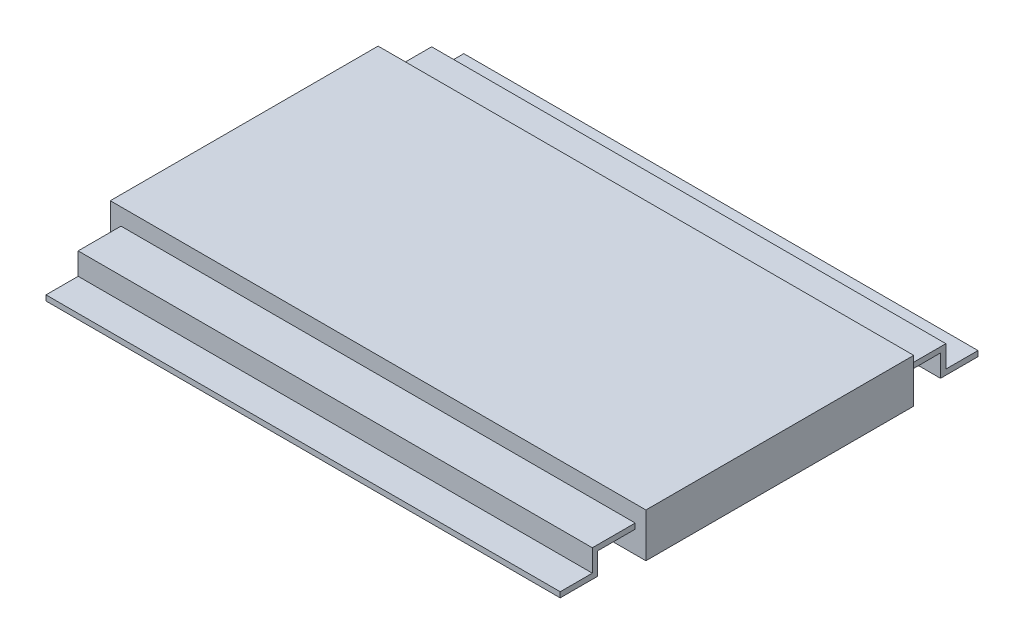
ISO-10303-21;
HEADER;
FILE_DESCRIPTION(('STEP AP214'),'2;1');
FILE_NAME('part.step','',(''),(''),'','','');
FILE_SCHEMA(('AUTOMOTIVE_DESIGN { 1 0 10303 214 1 1 1 1 }'));
ENDSEC;
DATA;
#1=APPLICATION_CONTEXT('core data for automotive mechanical design processes');
#2=APPLICATION_PROTOCOL_DEFINITION('international standard','automotive_design',2000,#1);
#3=PRODUCT_CONTEXT('',#1,'mechanical');
#4=PRODUCT('Part','Part','',(#3));
#5=PRODUCT_RELATED_PRODUCT_CATEGORY('part','',(#4));
#6=PRODUCT_DEFINITION_FORMATION('','',#4);
#7=PRODUCT_DEFINITION_CONTEXT('part definition',#1,'design');
#8=PRODUCT_DEFINITION('design','',#6,#7);
#9=PRODUCT_DEFINITION_SHAPE('','',#8);
#10=(LENGTH_UNIT() NAMED_UNIT(*) SI_UNIT(.MILLI.,.METRE.));
#11=(NAMED_UNIT(*) PLANE_ANGLE_UNIT() SI_UNIT($,.RADIAN.));
#12=(NAMED_UNIT(*) SI_UNIT($,.STERADIAN.) SOLID_ANGLE_UNIT());
#13=UNCERTAINTY_MEASURE_WITH_UNIT(LENGTH_MEASURE(1.E-05),#10,'distance_accuracy_value','');
#14=(GEOMETRIC_REPRESENTATION_CONTEXT(3) GLOBAL_UNCERTAINTY_ASSIGNED_CONTEXT((#13)) GLOBAL_UNIT_ASSIGNED_CONTEXT((#10,
#11,#12)) REPRESENTATION_CONTEXT('',''));
#15=CARTESIAN_POINT('',(0.,0.,0.));
#16=DIRECTION('',(0.,0.,1.));
#17=DIRECTION('',(1.,0.,0.));
#18=AXIS2_PLACEMENT_3D('',#15,#16,#17);
#19=CARTESIAN_POINT('',(6.35,1.044000004,3.175));
#20=DIRECTION('',(0.,0.,-1.));
#21=DIRECTION('',(0.,1.,0.));
#22=AXIS2_PLACEMENT_3D('',#19,#20,#21);
#23=PLANE('',#22);
#24=DIRECTION('',(0.,-1.,0.));
#25=VECTOR('',#24,1.);
#26=CARTESIAN_POINT('',(-6.35,1.044000004,3.175));
#27=LINE('',#26,#25);
#28=CARTESIAN_POINT('',(-6.35,1.044000004,3.175));
#29=VERTEX_POINT('',#28);
#30=CARTESIAN_POINT('',(-6.35,0.,3.175));
#31=VERTEX_POINT('',#30);
#32=EDGE_CURVE('E302',#29,#31,#27,.T.);
#33=ORIENTED_EDGE('',*,*,#32,.T.);
#34=DIRECTION('',(-1.,0.,0.));
#35=VECTOR('',#34,1.);
#36=CARTESIAN_POINT('',(6.35,0.,3.175));
#37=LINE('',#36,#35);
#38=CARTESIAN_POINT('',(6.35,0.,3.175));
#39=VERTEX_POINT('',#38);
#40=EDGE_CURVE('E11',#39,#31,#37,.T.);
#41=ORIENTED_EDGE('',*,*,#40,.F.);
#42=DIRECTION('',(0.,-1.,0.));
#43=VECTOR('',#42,1.);
#44=CARTESIAN_POINT('',(6.35,1.044000004,3.175));
#45=LINE('',#44,#43);
#46=CARTESIAN_POINT('',(6.35,1.044000004,3.175));
#47=VERTEX_POINT('',#46);
#48=EDGE_CURVE('E303',#47,#39,#45,.T.);
#49=ORIENTED_EDGE('',*,*,#48,.F.);
#50=DIRECTION('',(-1.,0.,0.));
#51=VECTOR('',#50,1.);
#52=CARTESIAN_POINT('',(6.35,1.044000004,3.175));
#53=LINE('',#52,#51);
#54=EDGE_CURVE('E313',#47,#29,#53,.T.);
#55=ORIENTED_EDGE('',*,*,#54,.T.);
#56=EDGE_LOOP('',(#33,#41,#49,#55));
#57=FACE_BOUND('',#56,.T.);
#58=DIRECTION('',(0.,1.,0.));
#59=VECTOR('',#58,1.);
#60=CARTESIAN_POINT('',(6.096,0.522000002000001,3.175));
#61=LINE('',#60,#59);
#62=CARTESIAN_POINT('',(6.096,0.522000002000001,3.175));
#63=VERTEX_POINT('',#62);
#64=CARTESIAN_POINT('',(6.096,0.649000002000001,3.175));
#65=VERTEX_POINT('',#64);
#66=EDGE_CURVE('E199',#63,#65,#61,.T.);
#67=ORIENTED_EDGE('',*,*,#66,.F.);
#68=DIRECTION('',(-1.,0.,0.));
#69=VECTOR('',#68,1.);
#70=CARTESIAN_POINT('',(6.096,0.522000002000001,3.175));
#71=LINE('',#70,#69);
#72=CARTESIAN_POINT('',(-6.096,0.522000002000001,3.175));
#73=VERTEX_POINT('',#72);
#74=EDGE_CURVE('E239',#63,#73,#71,.T.);
#75=ORIENTED_EDGE('',*,*,#74,.T.);
#76=DIRECTION('',(0.,1.,0.));
#77=VECTOR('',#76,1.);
#78=CARTESIAN_POINT('',(-6.096,0.522000002000001,3.175));
#79=LINE('',#78,#77);
#80=CARTESIAN_POINT('',(-6.096,0.649000002000001,3.175));
#81=VERTEX_POINT('',#80);
#82=EDGE_CURVE('E217',#73,#81,#79,.T.);
#83=ORIENTED_EDGE('',*,*,#82,.T.);
#84=DIRECTION('',(-1.,0.,0.));
#85=VECTOR('',#84,1.);
#86=CARTESIAN_POINT('',(6.096,0.649000002000001,3.175));
#87=LINE('',#86,#85);
#88=EDGE_CURVE('E237',#65,#81,#87,.T.);
#89=ORIENTED_EDGE('',*,*,#88,.F.);
#90=EDGE_LOOP('',(#67,#75,#83,#89));
#91=FACE_BOUND('',#90,.T.);
#92=ADVANCED_FACE('F35',(#57,#91),#23,.F.);
#93=CARTESIAN_POINT('',(6.35,1.044000004,-3.175));
#94=DIRECTION('',(0.,0.,1.));
#95=DIRECTION('',(0.,-1.,0.));
#96=AXIS2_PLACEMENT_3D('',#93,#94,#95);
#97=PLANE('',#96);
#98=DIRECTION('',(0.,1.,0.));
#99=VECTOR('',#98,1.);
#100=CARTESIAN_POINT('',(-6.35,1.044000004,-3.175));
#101=LINE('',#100,#99);
#102=CARTESIAN_POINT('',(-6.35,0.,-3.175));
#103=VERTEX_POINT('',#102);
#104=CARTESIAN_POINT('',(-6.35,1.044000004,-3.175));
#105=VERTEX_POINT('',#104);
#106=EDGE_CURVE('E318',#103,#105,#101,.T.);
#107=ORIENTED_EDGE('',*,*,#106,.T.);
#108=DIRECTION('',(-1.,0.,0.));
#109=VECTOR('',#108,1.);
#110=CARTESIAN_POINT('',(6.35,1.044000004,-3.175));
#111=LINE('',#110,#109);
#112=CARTESIAN_POINT('',(6.35,1.044000004,-3.175));
#113=VERTEX_POINT('',#112);
#114=EDGE_CURVE('E323',#113,#105,#111,.T.);
#115=ORIENTED_EDGE('',*,*,#114,.F.);
#116=DIRECTION('',(0.,1.,0.));
#117=VECTOR('',#116,1.);
#118=CARTESIAN_POINT('',(6.35,1.044000004,-3.175));
#119=LINE('',#118,#117);
#120=CARTESIAN_POINT('',(6.35,0.,-3.175));
#121=VERTEX_POINT('',#120);
#122=EDGE_CURVE('E309',#121,#113,#119,.T.);
#123=ORIENTED_EDGE('',*,*,#122,.F.);
#124=DIRECTION('',(-1.,0.,0.));
#125=VECTOR('',#124,1.);
#126=CARTESIAN_POINT('',(6.35,0.,-3.175));
#127=LINE('',#126,#125);
#128=EDGE_CURVE('E42',#121,#103,#127,.T.);
#129=ORIENTED_EDGE('',*,*,#128,.T.);
#130=EDGE_LOOP('',(#107,#115,#123,#129));
#131=FACE_BOUND('',#130,.T.);
#132=DIRECTION('',(0.,1.,0.));
#133=VECTOR('',#132,1.);
#134=CARTESIAN_POINT('',(6.096,0.522000002000001,-3.175));
#135=LINE('',#134,#133);
#136=CARTESIAN_POINT('',(6.096,0.522000002000001,-3.175));
#137=VERTEX_POINT('',#136);
#138=CARTESIAN_POINT('',(6.096,0.649000002000001,-3.175));
#139=VERTEX_POINT('',#138);
#140=EDGE_CURVE('E258',#137,#139,#135,.T.);
#141=ORIENTED_EDGE('',*,*,#140,.T.);
#142=DIRECTION('',(-1.,0.,0.));
#143=VECTOR('',#142,1.);
#144=CARTESIAN_POINT('',(6.096,0.649000002000001,-3.175));
#145=LINE('',#144,#143);
#146=CARTESIAN_POINT('',(-6.096,0.649000002000001,-3.175));
#147=VERTEX_POINT('',#146);
#148=EDGE_CURVE('E291',#139,#147,#145,.T.);
#149=ORIENTED_EDGE('',*,*,#148,.T.);
#150=DIRECTION('',(0.,1.,0.));
#151=VECTOR('',#150,1.);
#152=CARTESIAN_POINT('',(-6.096,0.522000002000001,-3.175));
#153=LINE('',#152,#151);
#154=CARTESIAN_POINT('',(-6.096,0.522000002000001,-3.175));
#155=VERTEX_POINT('',#154);
#156=EDGE_CURVE('E280',#155,#147,#153,.T.);
#157=ORIENTED_EDGE('',*,*,#156,.F.);
#158=DIRECTION('',(-1.,0.,0.));
#159=VECTOR('',#158,1.);
#160=CARTESIAN_POINT('',(6.096,0.522000002000001,-3.175));
#161=LINE('',#160,#159);
#162=EDGE_CURVE('E289',#137,#155,#161,.T.);
#163=ORIENTED_EDGE('',*,*,#162,.F.);
#164=EDGE_LOOP('',(#141,#149,#157,#163));
#165=FACE_BOUND('',#164,.T.);
#166=ADVANCED_FACE('F330',(#131,#165),#97,.F.);
#167=CARTESIAN_POINT('',(6.35,0.,3.175));
#168=DIRECTION('',(0.,1.,0.));
#169=DIRECTION('',(0.,0.,1.));
#170=AXIS2_PLACEMENT_3D('',#167,#168,#169);
#171=PLANE('',#170);
#172=DIRECTION('',(0.,0.,-1.));
#173=VECTOR('',#172,1.);
#174=CARTESIAN_POINT('',(-6.35,0.,3.175));
#175=LINE('',#174,#173);
#176=EDGE_CURVE('E316',#31,#103,#175,.T.);
#177=ORIENTED_EDGE('',*,*,#176,.T.);
#178=ORIENTED_EDGE('',*,*,#128,.F.);
#179=DIRECTION('',(0.,0.,-1.));
#180=VECTOR('',#179,1.);
#181=CARTESIAN_POINT('',(6.35,0.,3.175));
#182=LINE('',#181,#180);
#183=EDGE_CURVE('E306',#39,#121,#182,.T.);
#184=ORIENTED_EDGE('',*,*,#183,.F.);
#185=ORIENTED_EDGE('',*,*,#40,.T.);
#186=EDGE_LOOP('',(#177,#178,#184,#185));
#187=FACE_BOUND('',#186,.T.);
#188=ADVANCED_FACE('F348',(#187),#171,.F.);
#189=CARTESIAN_POINT('',(6.35,1.044000004,3.175));
#190=DIRECTION('',(0.,-1.,0.));
#191=DIRECTION('',(0.,0.,-1.));
#192=AXIS2_PLACEMENT_3D('',#189,#190,#191);
#193=PLANE('',#192);
#194=DIRECTION('',(0.,0.,1.));
#195=VECTOR('',#194,1.);
#196=CARTESIAN_POINT('',(-6.35,1.044000004,3.175));
#197=LINE('',#196,#195);
#198=EDGE_CURVE('E307',#105,#29,#197,.T.);
#199=ORIENTED_EDGE('',*,*,#198,.T.);
#200=ORIENTED_EDGE('',*,*,#54,.F.);
#201=DIRECTION('',(0.,0.,1.));
#202=VECTOR('',#201,1.);
#203=CARTESIAN_POINT('',(6.35,1.044000004,3.175));
#204=LINE('',#203,#202);
#205=EDGE_CURVE('E311',#113,#47,#204,.T.);
#206=ORIENTED_EDGE('',*,*,#205,.F.);
#207=ORIENTED_EDGE('',*,*,#114,.T.);
#208=EDGE_LOOP('',(#199,#200,#206,#207));
#209=FACE_BOUND('',#208,.T.);
#210=ADVANCED_FACE('F340',(#209),#193,.F.);
#211=CARTESIAN_POINT('',(6.35,0.,0.));
#212=DIRECTION('',(1.,0.,0.));
#213=DIRECTION('',(0.,0.,-1.));
#214=AXIS2_PLACEMENT_3D('',#211,#212,#213);
#215=PLANE('',#214);
#216=ORIENTED_EDGE('',*,*,#48,.T.);
#217=ORIENTED_EDGE('',*,*,#183,.T.);
#218=ORIENTED_EDGE('',*,*,#122,.T.);
#219=ORIENTED_EDGE('',*,*,#205,.T.);
#220=EDGE_LOOP('',(#216,#217,#218,#219));
#221=FACE_BOUND('',#220,.T.);
#222=ADVANCED_FACE('F347',(#221),#215,.T.);
#223=CARTESIAN_POINT('',(-6.35,0.,0.));
#224=DIRECTION('',(1.,0.,0.));
#225=DIRECTION('',(0.,0.,-1.));
#226=AXIS2_PLACEMENT_3D('',#223,#224,#225);
#227=PLANE('',#226);
#228=ORIENTED_EDGE('',*,*,#32,.F.);
#229=ORIENTED_EDGE('',*,*,#198,.F.);
#230=ORIENTED_EDGE('',*,*,#106,.F.);
#231=ORIENTED_EDGE('',*,*,#176,.F.);
#232=EDGE_LOOP('',(#228,#229,#230,#231));
#233=FACE_BOUND('',#232,.T.);
#234=ADVANCED_FACE('F337',(#233),#227,.F.);
#235=CARTESIAN_POINT('',(6.096,0.,-4.064));
#236=DIRECTION('',(0.,1.,0.));
#237=DIRECTION('',(0.,0.,1.));
#238=AXIS2_PLACEMENT_3D('',#235,#236,#237);
#239=PLANE('',#238);
#240=DIRECTION('',(0.,0.,-1.));
#241=VECTOR('',#240,1.);
#242=CARTESIAN_POINT('',(-6.096,0.,-4.064));
#243=LINE('',#242,#241);
#244=CARTESIAN_POINT('',(-6.096,0.,-4.064));
#245=VERTEX_POINT('',#244);
#246=CARTESIAN_POINT('',(-6.096,0.,-4.953));
#247=VERTEX_POINT('',#246);
#248=EDGE_CURVE('E182',#245,#247,#243,.T.);
#249=ORIENTED_EDGE('',*,*,#248,.T.);
#250=DIRECTION('',(-1.,0.,0.));
#251=VECTOR('',#250,1.);
#252=CARTESIAN_POINT('',(6.096,0.,-4.953));
#253=LINE('',#252,#251);
#254=CARTESIAN_POINT('',(6.096,0.,-4.953));
#255=VERTEX_POINT('',#254);
#256=EDGE_CURVE('E300',#255,#247,#253,.T.);
#257=ORIENTED_EDGE('',*,*,#256,.F.);
#258=DIRECTION('',(0.,0.,-1.));
#259=VECTOR('',#258,1.);
#260=CARTESIAN_POINT('',(6.096,0.,-4.064));
#261=LINE('',#260,#259);
#262=CARTESIAN_POINT('',(6.096,0.,-4.064));
#263=VERTEX_POINT('',#262);
#264=EDGE_CURVE('E243',#263,#255,#261,.T.);
#265=ORIENTED_EDGE('',*,*,#264,.F.);
#266=DIRECTION('',(-1.,0.,0.));
#267=VECTOR('',#266,1.);
#268=CARTESIAN_POINT('',(6.096,0.,-4.064));
#269=LINE('',#268,#267);
#270=EDGE_CURVE('E265',#263,#245,#269,.T.);
#271=ORIENTED_EDGE('',*,*,#270,.T.);
#272=EDGE_LOOP('',(#249,#257,#265,#271));
#273=FACE_BOUND('',#272,.T.);
#274=ADVANCED_FACE('F376',(#273),#239,.F.);
#275=CARTESIAN_POINT('',(6.096,0.127,-4.953));
#276=DIRECTION('',(0.,0.,-1.));
#277=DIRECTION('',(-1.,0.,0.));
#278=AXIS2_PLACEMENT_3D('',#275,#276,#277);
#279=PLANE('',#278);
#280=DIRECTION('',(0.,-1.,0.));
#281=VECTOR('',#280,1.);
#282=CARTESIAN_POINT('',(-6.096,0.127,-4.953));
#283=LINE('',#282,#281);
#284=CARTESIAN_POINT('',(-6.096,0.127,-4.953));
#285=VERTEX_POINT('',#284);
#286=EDGE_CURVE('E268',#285,#247,#283,.T.);
#287=ORIENTED_EDGE('',*,*,#286,.F.);
#288=DIRECTION('',(-1.,0.,0.));
#289=VECTOR('',#288,1.);
#290=CARTESIAN_POINT('',(6.096,0.127,-4.953));
#291=LINE('',#290,#289);
#292=CARTESIAN_POINT('',(6.096,0.127,-4.953));
#293=VERTEX_POINT('',#292);
#294=EDGE_CURVE('E298',#293,#285,#291,.T.);
#295=ORIENTED_EDGE('',*,*,#294,.F.);
#296=DIRECTION('',(0.,-1.,0.));
#297=VECTOR('',#296,1.);
#298=CARTESIAN_POINT('',(6.096,0.127,-4.953));
#299=LINE('',#298,#297);
#300=EDGE_CURVE('E245',#293,#255,#299,.T.);
#301=ORIENTED_EDGE('',*,*,#300,.T.);
#302=ORIENTED_EDGE('',*,*,#256,.T.);
#303=EDGE_LOOP('',(#287,#295,#301,#302));
#304=FACE_BOUND('',#303,.T.);
#305=ADVANCED_FACE('F380',(#304),#279,.T.);
#306=CARTESIAN_POINT('',(6.096,0.127,-4.064));
#307=DIRECTION('',(0.,1.,0.));
#308=DIRECTION('',(0.,0.,1.));
#309=AXIS2_PLACEMENT_3D('',#306,#307,#308);
#310=PLANE('',#309);
#311=DIRECTION('',(0.,0.,-1.));
#312=VECTOR('',#311,1.);
#313=CARTESIAN_POINT('',(-6.096,0.127,-4.064));
#314=LINE('',#313,#312);
#315=CARTESIAN_POINT('',(-6.096,0.127,-4.191));
#316=VERTEX_POINT('',#315);
#317=EDGE_CURVE('E271',#316,#285,#314,.T.);
#318=ORIENTED_EDGE('',*,*,#317,.F.);
#319=DIRECTION('',(-1.,0.,0.));
#320=VECTOR('',#319,1.);
#321=CARTESIAN_POINT('',(6.096,0.127,-4.191));
#322=LINE('',#321,#320);
#323=CARTESIAN_POINT('',(6.096,0.127,-4.191));
#324=VERTEX_POINT('',#323);
#325=EDGE_CURVE('E296',#324,#316,#322,.T.);
#326=ORIENTED_EDGE('',*,*,#325,.F.);
#327=DIRECTION('',(0.,0.,-1.));
#328=VECTOR('',#327,1.);
#329=CARTESIAN_POINT('',(6.096,0.127,-4.064));
#330=LINE('',#329,#328);
#331=EDGE_CURVE('E249',#324,#293,#330,.T.);
#332=ORIENTED_EDGE('',*,*,#331,.T.);
#333=ORIENTED_EDGE('',*,*,#294,.T.);
#334=EDGE_LOOP('',(#318,#326,#332,#333));
#335=FACE_BOUND('',#334,.T.);
#336=ADVANCED_FACE('F390',(#335),#310,.T.);
#337=CARTESIAN_POINT('',(6.096,0.522000002000001,-4.191));
#338=DIRECTION('',(0.,0.,-1.));
#339=DIRECTION('',(-1.,0.,0.));
#340=AXIS2_PLACEMENT_3D('',#337,#338,#339);
#341=PLANE('',#340);
#342=DIRECTION('',(0.,1.,0.));
#343=VECTOR('',#342,1.);
#344=CARTESIAN_POINT('',(-6.096,0.522000002000001,-4.191));
#345=LINE('',#344,#343);
#346=CARTESIAN_POINT('',(-6.096,0.649000002000001,-4.191));
#347=VERTEX_POINT('',#346);
#348=EDGE_CURVE('E274',#347,#316,#345,.F.);
#349=ORIENTED_EDGE('',*,*,#348,.F.);
#350=DIRECTION('',(-1.,0.,0.));
#351=VECTOR('',#350,1.);
#352=CARTESIAN_POINT('',(6.096,0.649000002000001,-4.191));
#353=LINE('',#352,#351);
#354=CARTESIAN_POINT('',(6.096,0.649000002000001,-4.191));
#355=VERTEX_POINT('',#354);
#356=EDGE_CURVE('E294',#355,#347,#353,.T.);
#357=ORIENTED_EDGE('',*,*,#356,.F.);
#358=DIRECTION('',(0.,1.,0.));
#359=VECTOR('',#358,1.);
#360=CARTESIAN_POINT('',(6.096,0.522000002000001,-4.191));
#361=LINE('',#360,#359);
#362=EDGE_CURVE('E252',#355,#324,#361,.F.);
#363=ORIENTED_EDGE('',*,*,#362,.T.);
#364=ORIENTED_EDGE('',*,*,#325,.T.);
#365=EDGE_LOOP('',(#349,#357,#363,#364));
#366=FACE_BOUND('',#365,.T.);
#367=ADVANCED_FACE('F400',(#366),#341,.T.);
#368=CARTESIAN_POINT('',(6.096,0.649000002000001,-3.175));
#369=DIRECTION('',(0.,1.,0.));
#370=DIRECTION('',(0.,0.,1.));
#371=AXIS2_PLACEMENT_3D('',#368,#369,#370);
#372=PLANE('',#371);
#373=DIRECTION('',(0.,0.,-1.));
#374=VECTOR('',#373,1.);
#375=CARTESIAN_POINT('',(-6.096,0.649000002000001,-3.175));
#376=LINE('',#375,#374);
#377=EDGE_CURVE('E277',#147,#347,#376,.T.);
#378=ORIENTED_EDGE('',*,*,#377,.F.);
#379=ORIENTED_EDGE('',*,*,#148,.F.);
#380=DIRECTION('',(0.,0.,-1.));
#381=VECTOR('',#380,1.);
#382=CARTESIAN_POINT('',(6.096,0.649000002000001,-3.175));
#383=LINE('',#382,#381);
#384=EDGE_CURVE('E255',#139,#355,#383,.T.);
#385=ORIENTED_EDGE('',*,*,#384,.T.);
#386=ORIENTED_EDGE('',*,*,#356,.T.);
#387=EDGE_LOOP('',(#378,#379,#385,#386));
#388=FACE_BOUND('',#387,.T.);
#389=ADVANCED_FACE('F410',(#388),#372,.T.);
#390=CARTESIAN_POINT('',(6.096,0.522000002000001,-3.175));
#391=DIRECTION('',(0.,1.,0.));
#392=DIRECTION('',(0.,0.,1.));
#393=AXIS2_PLACEMENT_3D('',#390,#391,#392);
#394=PLANE('',#393);
#395=DIRECTION('',(0.,0.,-1.));
#396=VECTOR('',#395,1.);
#397=CARTESIAN_POINT('',(-6.096,0.522000002000001,-3.175));
#398=LINE('',#397,#396);
#399=CARTESIAN_POINT('',(-6.096,0.522000002000001,-4.064));
#400=VERTEX_POINT('',#399);
#401=EDGE_CURVE('E57',#155,#400,#398,.T.);
#402=ORIENTED_EDGE('',*,*,#401,.T.);
#403=DIRECTION('',(-1.,0.,0.));
#404=VECTOR('',#403,1.);
#405=CARTESIAN_POINT('',(6.096,0.522000002000001,-4.064));
#406=LINE('',#405,#404);
#407=CARTESIAN_POINT('',(6.096,0.522000002000001,-4.064));
#408=VERTEX_POINT('',#407);
#409=EDGE_CURVE('E286',#408,#400,#406,.T.);
#410=ORIENTED_EDGE('',*,*,#409,.F.);
#411=DIRECTION('',(0.,0.,-1.));
#412=VECTOR('',#411,1.);
#413=CARTESIAN_POINT('',(6.096,0.522000002000001,-3.175));
#414=LINE('',#413,#412);
#415=EDGE_CURVE('E261',#137,#408,#414,.T.);
#416=ORIENTED_EDGE('',*,*,#415,.F.);
#417=ORIENTED_EDGE('',*,*,#162,.T.);
#418=EDGE_LOOP('',(#402,#410,#416,#417));
#419=FACE_BOUND('',#418,.T.);
#420=ADVANCED_FACE('F420',(#419),#394,.F.);
#421=CARTESIAN_POINT('',(6.096,0.522000002000001,-4.064));
#422=DIRECTION('',(0.,0.,-1.));
#423=DIRECTION('',(-1.,0.,0.));
#424=AXIS2_PLACEMENT_3D('',#421,#422,#423);
#425=PLANE('',#424);
#426=DIRECTION('',(0.,-1.,0.));
#427=VECTOR('',#426,1.);
#428=CARTESIAN_POINT('',(-6.096,0.522000002000001,-4.064));
#429=LINE('',#428,#427);
#430=EDGE_CURVE('E246',#400,#245,#429,.T.);
#431=ORIENTED_EDGE('',*,*,#430,.T.);
#432=ORIENTED_EDGE('',*,*,#270,.F.);
#433=DIRECTION('',(0.,-1.,0.));
#434=VECTOR('',#433,1.);
#435=CARTESIAN_POINT('',(6.096,0.522000002000001,-4.064));
#436=LINE('',#435,#434);
#437=EDGE_CURVE('E263',#408,#263,#436,.T.);
#438=ORIENTED_EDGE('',*,*,#437,.F.);
#439=ORIENTED_EDGE('',*,*,#409,.T.);
#440=EDGE_LOOP('',(#431,#432,#438,#439));
#441=FACE_BOUND('',#440,.T.);
#442=ADVANCED_FACE('F430',(#441),#425,.F.);
#443=CARTESIAN_POINT('',(6.096,0.,0.));
#444=DIRECTION('',(-1.,0.,0.));
#445=DIRECTION('',(0.,0.,1.));
#446=AXIS2_PLACEMENT_3D('',#443,#444,#445);
#447=PLANE('',#446);
#448=ORIENTED_EDGE('',*,*,#264,.T.);
#449=ORIENTED_EDGE('',*,*,#300,.F.);
#450=ORIENTED_EDGE('',*,*,#331,.F.);
#451=ORIENTED_EDGE('',*,*,#362,.F.);
#452=ORIENTED_EDGE('',*,*,#384,.F.);
#453=ORIENTED_EDGE('',*,*,#140,.F.);
#454=ORIENTED_EDGE('',*,*,#415,.T.);
#455=ORIENTED_EDGE('',*,*,#437,.T.);
#456=EDGE_LOOP('',(#448,#449,#450,#451,#452,#453,#454,#455));
#457=FACE_BOUND('',#456,.T.);
#458=ADVANCED_FACE('F440',(#457),#447,.F.);
#459=CARTESIAN_POINT('',(-6.096,0.,0.));
#460=DIRECTION('',(-1.,0.,0.));
#461=DIRECTION('',(0.,0.,1.));
#462=AXIS2_PLACEMENT_3D('',#459,#460,#461);
#463=PLANE('',#462);
#464=ORIENTED_EDGE('',*,*,#248,.F.);
#465=ORIENTED_EDGE('',*,*,#430,.F.);
#466=ORIENTED_EDGE('',*,*,#401,.F.);
#467=ORIENTED_EDGE('',*,*,#156,.T.);
#468=ORIENTED_EDGE('',*,*,#377,.T.);
#469=ORIENTED_EDGE('',*,*,#348,.T.);
#470=ORIENTED_EDGE('',*,*,#317,.T.);
#471=ORIENTED_EDGE('',*,*,#286,.T.);
#472=EDGE_LOOP('',(#464,#465,#466,#467,#468,#469,#470,#471));
#473=FACE_BOUND('',#472,.T.);
#474=ADVANCED_FACE('F449',(#473),#463,.T.);
#475=CARTESIAN_POINT('',(6.096,0.,4.064));
#476=DIRECTION('',(0.,-1.,0.));
#477=DIRECTION('',(0.,0.,-1.));
#478=AXIS2_PLACEMENT_3D('',#475,#476,#477);
#479=PLANE('',#478);
#480=DIRECTION('',(0.,0.,1.));
#481=VECTOR('',#480,1.);
#482=CARTESIAN_POINT('',(-6.096,0.,4.064));
#483=LINE('',#482,#481);
#484=CARTESIAN_POINT('',(-6.096,0.,4.064));
#485=VERTEX_POINT('',#484);
#486=CARTESIAN_POINT('',(-6.096,0.,4.953));
#487=VERTEX_POINT('',#486);
#488=EDGE_CURVE('E177',#485,#487,#483,.T.);
#489=ORIENTED_EDGE('',*,*,#488,.F.);
#490=DIRECTION('',(-1.,0.,0.));
#491=VECTOR('',#490,1.);
#492=CARTESIAN_POINT('',(6.096,0.,4.064));
#493=LINE('',#492,#491);
#494=CARTESIAN_POINT('',(6.096,0.,4.064));
#495=VERTEX_POINT('',#494);
#496=EDGE_CURVE('E172',#495,#485,#493,.T.);
#497=ORIENTED_EDGE('',*,*,#496,.F.);
#498=DIRECTION('',(0.,0.,1.));
#499=VECTOR('',#498,1.);
#500=CARTESIAN_POINT('',(6.096,0.,4.064));
#501=LINE('',#500,#499);
#502=CARTESIAN_POINT('',(6.096,0.,4.953));
#503=VERTEX_POINT('',#502);
#504=EDGE_CURVE('E175',#495,#503,#501,.T.);
#505=ORIENTED_EDGE('',*,*,#504,.T.);
#506=DIRECTION('',(-1.,0.,0.));
#507=VECTOR('',#506,1.);
#508=CARTESIAN_POINT('',(6.096,0.,4.953));
#509=LINE('',#508,#507);
#510=EDGE_CURVE('E210',#503,#487,#509,.T.);
#511=ORIENTED_EDGE('',*,*,#510,.T.);
#512=EDGE_LOOP('',(#489,#497,#505,#511));
#513=FACE_BOUND('',#512,.T.);
#514=ADVANCED_FACE('F174',(#513),#479,.T.);
#515=CARTESIAN_POINT('',(6.096,0.522000002000001,4.064));
#516=DIRECTION('',(0.,0.,-1.));
#517=DIRECTION('',(-1.,0.,0.));
#518=AXIS2_PLACEMENT_3D('',#515,#516,#517);
#519=PLANE('',#518);
#520=DIRECTION('',(0.,-1.,0.));
#521=VECTOR('',#520,1.);
#522=CARTESIAN_POINT('',(-6.096,0.522000002000001,4.064));
#523=LINE('',#522,#521);
#524=CARTESIAN_POINT('',(-6.096,0.522000002000001,4.064));
#525=VERTEX_POINT('',#524);
#526=EDGE_CURVE('E212',#525,#485,#523,.T.);
#527=ORIENTED_EDGE('',*,*,#526,.F.);
#528=DIRECTION('',(-1.,0.,0.));
#529=VECTOR('',#528,1.);
#530=CARTESIAN_POINT('',(6.096,0.522000002000001,4.064));
#531=LINE('',#530,#529);
#532=CARTESIAN_POINT('',(6.096,0.522000002000001,4.064));
#533=VERTEX_POINT('',#532);
#534=EDGE_CURVE('E183',#533,#525,#531,.T.);
#535=ORIENTED_EDGE('',*,*,#534,.F.);
#536=DIRECTION('',(0.,-1.,0.));
#537=VECTOR('',#536,1.);
#538=CARTESIAN_POINT('',(6.096,0.522000002000001,4.064));
#539=LINE('',#538,#537);
#540=EDGE_CURVE('E189',#533,#495,#539,.T.);
#541=ORIENTED_EDGE('',*,*,#540,.T.);
#542=ORIENTED_EDGE('',*,*,#496,.T.);
#543=EDGE_LOOP('',(#527,#535,#541,#542));
#544=FACE_BOUND('',#543,.T.);
#545=ADVANCED_FACE('F196',(#544),#519,.T.);
#546=CARTESIAN_POINT('',(6.096,0.522000002000001,3.175));
#547=DIRECTION('',(0.,-1.,0.));
#548=DIRECTION('',(0.,0.,-1.));
#549=AXIS2_PLACEMENT_3D('',#546,#547,#548);
#550=PLANE('',#549);
#551=DIRECTION('',(0.,0.,1.));
#552=VECTOR('',#551,1.);
#553=CARTESIAN_POINT('',(-6.096,0.522000002000001,3.175));
#554=LINE('',#553,#552);
#555=EDGE_CURVE('E214',#73,#525,#554,.T.);
#556=ORIENTED_EDGE('',*,*,#555,.F.);
#557=ORIENTED_EDGE('',*,*,#74,.F.);
#558=DIRECTION('',(0.,0.,1.));
#559=VECTOR('',#558,1.);
#560=CARTESIAN_POINT('',(6.096,0.522000002000001,3.175));
#561=LINE('',#560,#559);
#562=EDGE_CURVE('E197',#63,#533,#561,.T.);
#563=ORIENTED_EDGE('',*,*,#562,.T.);
#564=ORIENTED_EDGE('',*,*,#534,.T.);
#565=EDGE_LOOP('',(#556,#557,#563,#564));
#566=FACE_BOUND('',#565,.T.);
#567=ADVANCED_FACE('F471',(#566),#550,.T.);
#568=CARTESIAN_POINT('',(6.096,0.649000002000001,3.175));
#569=DIRECTION('',(0.,-1.,0.));
#570=DIRECTION('',(0.,0.,-1.));
#571=AXIS2_PLACEMENT_3D('',#568,#569,#570);
#572=PLANE('',#571);
#573=DIRECTION('',(0.,0.,1.));
#574=VECTOR('',#573,1.);
#575=CARTESIAN_POINT('',(-6.096,0.649000002000001,3.175));
#576=LINE('',#575,#574);
#577=CARTESIAN_POINT('',(-6.096,0.649000002000001,4.191));
#578=VERTEX_POINT('',#577);
#579=EDGE_CURVE('E49',#81,#578,#576,.T.);
#580=ORIENTED_EDGE('',*,*,#579,.T.);
#581=DIRECTION('',(-1.,0.,0.));
#582=VECTOR('',#581,1.);
#583=CARTESIAN_POINT('',(6.096,0.649000002000001,4.191));
#584=LINE('',#583,#582);
#585=CARTESIAN_POINT('',(6.096,0.649000002000001,4.191));
#586=VERTEX_POINT('',#585);
#587=EDGE_CURVE('E234',#586,#578,#584,.T.);
#588=ORIENTED_EDGE('',*,*,#587,.F.);
#589=DIRECTION('',(0.,0.,1.));
#590=VECTOR('',#589,1.);
#591=CARTESIAN_POINT('',(6.096,0.649000002000001,3.175));
#592=LINE('',#591,#590);
#593=EDGE_CURVE('E203',#65,#586,#592,.T.);
#594=ORIENTED_EDGE('',*,*,#593,.F.);
#595=ORIENTED_EDGE('',*,*,#88,.T.);
#596=EDGE_LOOP('',(#580,#588,#594,#595));
#597=FACE_BOUND('',#596,.T.);
#598=ADVANCED_FACE('F478',(#597),#572,.F.);
#599=CARTESIAN_POINT('',(6.096,0.522000002000001,4.191));
#600=DIRECTION('',(0.,0.,-1.));
#601=DIRECTION('',(-1.,0.,0.));
#602=AXIS2_PLACEMENT_3D('',#599,#600,#601);
#603=PLANE('',#602);
#604=DIRECTION('',(0.,1.,0.));
#605=VECTOR('',#604,1.);
#606=CARTESIAN_POINT('',(-6.096,0.522000002000001,4.191));
#607=LINE('',#606,#605);
#608=CARTESIAN_POINT('',(-6.096,0.127,4.191));
#609=VERTEX_POINT('',#608);
#610=EDGE_CURVE('E221',#578,#609,#607,.F.);
#611=ORIENTED_EDGE('',*,*,#610,.T.);
#612=DIRECTION('',(-1.,0.,0.));
#613=VECTOR('',#612,1.);
#614=CARTESIAN_POINT('',(6.096,0.127,4.191));
#615=LINE('',#614,#613);
#616=CARTESIAN_POINT('',(6.096,0.127,4.191));
#617=VERTEX_POINT('',#616);
#618=EDGE_CURVE('E231',#617,#609,#615,.T.);
#619=ORIENTED_EDGE('',*,*,#618,.F.);
#620=DIRECTION('',(0.,1.,0.));
#621=VECTOR('',#620,1.);
#622=CARTESIAN_POINT('',(6.096,0.522000002000001,4.191));
#623=LINE('',#622,#621);
#624=EDGE_CURVE('E205',#586,#617,#623,.F.);
#625=ORIENTED_EDGE('',*,*,#624,.F.);
#626=ORIENTED_EDGE('',*,*,#587,.T.);
#627=EDGE_LOOP('',(#611,#619,#625,#626));
#628=FACE_BOUND('',#627,.T.);
#629=ADVANCED_FACE('F486',(#628),#603,.F.);
#630=CARTESIAN_POINT('',(6.096,0.127,4.064));
#631=DIRECTION('',(0.,-1.,0.));
#632=DIRECTION('',(0.,0.,-1.));
#633=AXIS2_PLACEMENT_3D('',#630,#631,#632);
#634=PLANE('',#633);
#635=DIRECTION('',(0.,0.,1.));
#636=VECTOR('',#635,1.);
#637=CARTESIAN_POINT('',(-6.096,0.127,4.064));
#638=LINE('',#637,#636);
#639=CARTESIAN_POINT('',(-6.096,0.127,4.953));
#640=VERTEX_POINT('',#639);
#641=EDGE_CURVE('E223',#609,#640,#638,.T.);
#642=ORIENTED_EDGE('',*,*,#641,.T.);
#643=DIRECTION('',(-1.,0.,0.));
#644=VECTOR('',#643,1.);
#645=CARTESIAN_POINT('',(6.096,0.127,4.953));
#646=LINE('',#645,#644);
#647=CARTESIAN_POINT('',(6.096,0.127,4.953));
#648=VERTEX_POINT('',#647);
#649=EDGE_CURVE('E228',#648,#640,#646,.T.);
#650=ORIENTED_EDGE('',*,*,#649,.F.);
#651=DIRECTION('',(0.,0.,1.));
#652=VECTOR('',#651,1.);
#653=CARTESIAN_POINT('',(6.096,0.127,4.064));
#654=LINE('',#653,#652);
#655=EDGE_CURVE('E207',#617,#648,#654,.T.);
#656=ORIENTED_EDGE('',*,*,#655,.F.);
#657=ORIENTED_EDGE('',*,*,#618,.T.);
#658=EDGE_LOOP('',(#642,#650,#656,#657));
#659=FACE_BOUND('',#658,.T.);
#660=ADVANCED_FACE('F494',(#659),#634,.F.);
#661=CARTESIAN_POINT('',(6.096,0.127,4.953));
#662=DIRECTION('',(0.,0.,-1.));
#663=DIRECTION('',(-1.,0.,0.));
#664=AXIS2_PLACEMENT_3D('',#661,#662,#663);
#665=PLANE('',#664);
#666=DIRECTION('',(0.,-1.,0.));
#667=VECTOR('',#666,1.);
#668=CARTESIAN_POINT('',(-6.096,0.127,4.953));
#669=LINE('',#668,#667);
#670=EDGE_CURVE('E194',#640,#487,#669,.T.);
#671=ORIENTED_EDGE('',*,*,#670,.T.);
#672=ORIENTED_EDGE('',*,*,#510,.F.);
#673=DIRECTION('',(0.,-1.,0.));
#674=VECTOR('',#673,1.);
#675=CARTESIAN_POINT('',(6.096,0.127,4.953));
#676=LINE('',#675,#674);
#677=EDGE_CURVE('E192',#648,#503,#676,.T.);
#678=ORIENTED_EDGE('',*,*,#677,.F.);
#679=ORIENTED_EDGE('',*,*,#649,.T.);
#680=EDGE_LOOP('',(#671,#672,#678,#679));
#681=FACE_BOUND('',#680,.T.);
#682=ADVANCED_FACE('F502',(#681),#665,.F.);
#683=CARTESIAN_POINT('',(6.096,0.,0.));
#684=DIRECTION('',(-1.,0.,0.));
#685=DIRECTION('',(0.,0.,-1.));
#686=AXIS2_PLACEMENT_3D('',#683,#684,#685);
#687=PLANE('',#686);
#688=ORIENTED_EDGE('',*,*,#504,.F.);
#689=ORIENTED_EDGE('',*,*,#540,.F.);
#690=ORIENTED_EDGE('',*,*,#562,.F.);
#691=ORIENTED_EDGE('',*,*,#66,.T.);
#692=ORIENTED_EDGE('',*,*,#593,.T.);
#693=ORIENTED_EDGE('',*,*,#624,.T.);
#694=ORIENTED_EDGE('',*,*,#655,.T.);
#695=ORIENTED_EDGE('',*,*,#677,.T.);
#696=EDGE_LOOP('',(#688,#689,#690,#691,#692,#693,#694,#695));
#697=FACE_BOUND('',#696,.T.);
#698=ADVANCED_FACE('F187',(#697),#687,.F.);
#699=CARTESIAN_POINT('',(-6.096,0.,0.));
#700=DIRECTION('',(-1.,0.,0.));
#701=DIRECTION('',(0.,0.,-1.));
#702=AXIS2_PLACEMENT_3D('',#699,#700,#701);
#703=PLANE('',#702);
#704=ORIENTED_EDGE('',*,*,#488,.T.);
#705=ORIENTED_EDGE('',*,*,#670,.F.);
#706=ORIENTED_EDGE('',*,*,#641,.F.);
#707=ORIENTED_EDGE('',*,*,#610,.F.);
#708=ORIENTED_EDGE('',*,*,#579,.F.);
#709=ORIENTED_EDGE('',*,*,#82,.F.);
#710=ORIENTED_EDGE('',*,*,#555,.T.);
#711=ORIENTED_EDGE('',*,*,#526,.T.);
#712=EDGE_LOOP('',(#704,#705,#706,#707,#708,#709,#710,#711));
#713=FACE_BOUND('',#712,.T.);
#714=ADVANCED_FACE('F517',(#713),#703,.T.);
#715=CLOSED_SHELL('',(#92,#166,#188,#210,#222,#234,#274,#305,#336,#367,#389,#420,#442,#458,#474,
#514,#545,#567,#598,#629,#660,#682,#698,#714));
#716=MANIFOLD_SOLID_BREP('B2',#715);
#717=ADVANCED_BREP_SHAPE_REPRESENTATION('',(#18,#716),#14);
#718=SHAPE_DEFINITION_REPRESENTATION(#9,#717);
ENDSEC;
END-ISO-10303-21;
